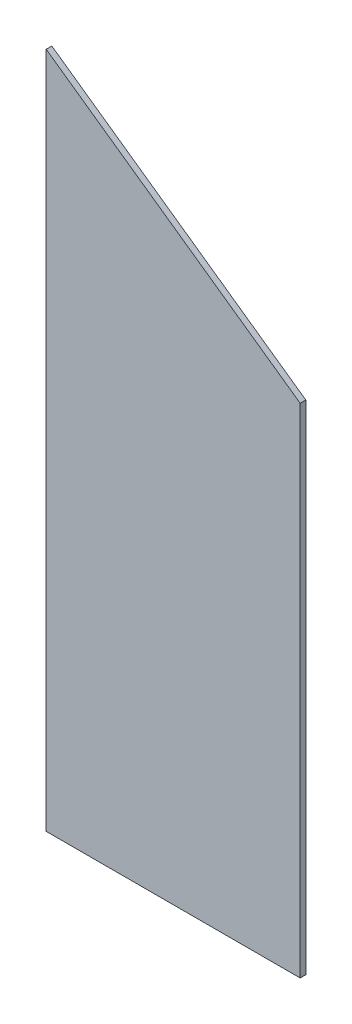
ISO-10303-21;
HEADER;
FILE_DESCRIPTION(('STEP AP214'),'2;1');
FILE_NAME('part.step','',(''),(''),'','','');
FILE_SCHEMA(('AUTOMOTIVE_DESIGN { 1 0 10303 214 1 1 1 1 }'));
ENDSEC;
DATA;
#1=APPLICATION_CONTEXT('core data for automotive mechanical design processes');
#2=APPLICATION_PROTOCOL_DEFINITION('international standard','automotive_design',2000,#1);
#3=PRODUCT_CONTEXT('',#1,'mechanical');
#4=PRODUCT('Part','Part','',(#3));
#5=PRODUCT_RELATED_PRODUCT_CATEGORY('part','',(#4));
#6=PRODUCT_DEFINITION_FORMATION('','',#4);
#7=PRODUCT_DEFINITION_CONTEXT('part definition',#1,'design');
#8=PRODUCT_DEFINITION('design','',#6,#7);
#9=PRODUCT_DEFINITION_SHAPE('','',#8);
#10=(LENGTH_UNIT() NAMED_UNIT(*) SI_UNIT(.MILLI.,.METRE.));
#11=(NAMED_UNIT(*) PLANE_ANGLE_UNIT() SI_UNIT($,.RADIAN.));
#12=(NAMED_UNIT(*) SI_UNIT($,.STERADIAN.) SOLID_ANGLE_UNIT());
#13=UNCERTAINTY_MEASURE_WITH_UNIT(LENGTH_MEASURE(1.E-05),#10,'distance_accuracy_value','');
#14=(GEOMETRIC_REPRESENTATION_CONTEXT(3) GLOBAL_UNCERTAINTY_ASSIGNED_CONTEXT((#13)) GLOBAL_UNIT_ASSIGNED_CONTEXT((#10,
#11,#12)) REPRESENTATION_CONTEXT('',''));
#15=CARTESIAN_POINT('',(0.,0.,0.));
#16=DIRECTION('',(0.,0.,1.));
#17=DIRECTION('',(1.,0.,0.));
#18=AXIS2_PLACEMENT_3D('',#15,#16,#17);
#19=CARTESIAN_POINT('',(90.,352.783521086218,-93.4));
#20=DIRECTION('',(-1.,0.,0.));
#21=DIRECTION('',(0.,-1.,0.));
#22=AXIS2_PLACEMENT_3D('',#19,#20,#21);
#23=PLANE('',#22);
#24=DIRECTION('',(0.,-1.,0.));
#25=VECTOR('',#24,1.);
#26=CARTESIAN_POINT('',(90.,352.783521086218,-89.4));
#27=LINE('',#26,#25);
#28=CARTESIAN_POINT('',(90.,352.783521086218,-89.4));
#29=VERTEX_POINT('',#28);
#30=CARTESIAN_POINT('',(90.,0.,-89.4));
#31=VERTEX_POINT('',#30);
#32=EDGE_CURVE('E109',#29,#31,#27,.T.);
#33=ORIENTED_EDGE('',*,*,#32,.T.);
#34=DIRECTION('',(0.,0.,1.));
#35=VECTOR('',#34,1.);
#36=CARTESIAN_POINT('',(90.,0.,-93.4));
#37=LINE('',#36,#35);
#38=CARTESIAN_POINT('',(90.,0.,-93.4));
#39=VERTEX_POINT('',#38);
#40=EDGE_CURVE('E11',#39,#31,#37,.T.);
#41=ORIENTED_EDGE('',*,*,#40,.F.);
#42=DIRECTION('',(0.,-1.,0.));
#43=VECTOR('',#42,1.);
#44=CARTESIAN_POINT('',(90.,352.783521086218,-93.4));
#45=LINE('',#44,#43);
#46=CARTESIAN_POINT('',(90.,352.783521086218,-93.4));
#47=VERTEX_POINT('',#46);
#48=EDGE_CURVE('E92',#47,#39,#45,.T.);
#49=ORIENTED_EDGE('',*,*,#48,.F.);
#50=DIRECTION('',(0.,0.,1.));
#51=VECTOR('',#50,1.);
#52=CARTESIAN_POINT('',(90.,352.783521086218,-93.4));
#53=LINE('',#52,#51);
#54=EDGE_CURVE('E105',#47,#29,#53,.T.);
#55=ORIENTED_EDGE('',*,*,#54,.T.);
#56=EDGE_LOOP('',(#33,#41,#49,#55));
#57=FACE_BOUND('',#56,.T.);
#58=ADVANCED_FACE('F40',(#57),#23,.F.);
#59=CARTESIAN_POINT('',(90.,0.,-93.4));
#60=DIRECTION('',(0.,1.,0.));
#61=DIRECTION('',(0.,0.,1.));
#62=AXIS2_PLACEMENT_3D('',#59,#60,#61);
#63=PLANE('',#62);
#64=DIRECTION('',(-1.,0.,0.));
#65=VECTOR('',#64,1.);
#66=CARTESIAN_POINT('',(90.,0.,-89.4));
#67=LINE('',#66,#65);
#68=CARTESIAN_POINT('',(-90.,0.,-89.4));
#69=VERTEX_POINT('',#68);
#70=EDGE_CURVE('E97',#31,#69,#67,.T.);
#71=ORIENTED_EDGE('',*,*,#70,.T.);
#72=DIRECTION('',(0.,0.,1.));
#73=VECTOR('',#72,1.);
#74=CARTESIAN_POINT('',(-90.,0.,-93.4));
#75=LINE('',#74,#73);
#76=CARTESIAN_POINT('',(-90.,0.,-93.4));
#77=VERTEX_POINT('',#76);
#78=EDGE_CURVE('E49',#77,#69,#75,.T.);
#79=ORIENTED_EDGE('',*,*,#78,.F.);
#80=DIRECTION('',(-1.,0.,0.));
#81=VECTOR('',#80,1.);
#82=CARTESIAN_POINT('',(90.,0.,-93.4));
#83=LINE('',#82,#81);
#84=EDGE_CURVE('E87',#39,#77,#83,.T.);
#85=ORIENTED_EDGE('',*,*,#84,.F.);
#86=ORIENTED_EDGE('',*,*,#40,.T.);
#87=EDGE_LOOP('',(#71,#79,#85,#86));
#88=FACE_BOUND('',#87,.T.);
#89=ADVANCED_FACE('F96',(#88),#63,.F.);
#90=CARTESIAN_POINT('',(-90.,0.,-93.4));
#91=DIRECTION('',(1.,0.,0.));
#92=DIRECTION('',(0.,0.,-1.));
#93=AXIS2_PLACEMENT_3D('',#90,#91,#92);
#94=PLANE('',#93);
#95=DIRECTION('',(0.,1.,0.));
#96=VECTOR('',#95,1.);
#97=CARTESIAN_POINT('',(-90.,0.,-89.4));
#98=LINE('',#97,#96);
#99=CARTESIAN_POINT('',(-90.,480.062741699798,-89.4));
#100=VERTEX_POINT('',#99);
#101=EDGE_CURVE('E74',#69,#100,#98,.T.);
#102=ORIENTED_EDGE('',*,*,#101,.T.);
#103=DIRECTION('',(0.,0.,1.));
#104=VECTOR('',#103,1.);
#105=CARTESIAN_POINT('',(-90.,480.062741699798,-93.4));
#106=LINE('',#105,#104);
#107=CARTESIAN_POINT('',(-90.,480.062741699798,-93.4));
#108=VERTEX_POINT('',#107);
#109=EDGE_CURVE('E99',#108,#100,#106,.T.);
#110=ORIENTED_EDGE('',*,*,#109,.F.);
#111=DIRECTION('',(0.,1.,0.));
#112=VECTOR('',#111,1.);
#113=CARTESIAN_POINT('',(-90.,0.,-93.4));
#114=LINE('',#113,#112);
#115=EDGE_CURVE('E90',#77,#108,#114,.T.);
#116=ORIENTED_EDGE('',*,*,#115,.F.);
#117=ORIENTED_EDGE('',*,*,#78,.T.);
#118=EDGE_LOOP('',(#102,#110,#116,#117));
#119=FACE_BOUND('',#118,.T.);
#120=ADVANCED_FACE('F100',(#119),#94,.F.);
#121=CARTESIAN_POINT('',(-90.,480.062741699798,-93.4));
#122=DIRECTION('',(-0.577350269189629,-0.816496580927723,0.));
#123=DIRECTION('',(0.816496580927723,-0.577350269189629,0.));
#124=AXIS2_PLACEMENT_3D('',#121,#122,#123);
#125=PLANE('',#124);
#126=DIRECTION('',(0.816496580927723,-0.577350269189629,0.));
#127=VECTOR('',#126,1.);
#128=CARTESIAN_POINT('',(-90.,480.062741699798,-89.4));
#129=LINE('',#128,#127);
#130=EDGE_CURVE('E80',#100,#29,#129,.T.);
#131=ORIENTED_EDGE('',*,*,#130,.T.);
#132=ORIENTED_EDGE('',*,*,#54,.F.);
#133=DIRECTION('',(0.816496580927723,-0.577350269189629,0.));
#134=VECTOR('',#133,1.);
#135=CARTESIAN_POINT('',(-90.,480.062741699798,-93.4));
#136=LINE('',#135,#134);
#137=EDGE_CURVE('E57',#108,#47,#136,.T.);
#138=ORIENTED_EDGE('',*,*,#137,.F.);
#139=ORIENTED_EDGE('',*,*,#109,.T.);
#140=EDGE_LOOP('',(#131,#132,#138,#139));
#141=FACE_BOUND('',#140,.T.);
#142=ADVANCED_FACE('F124',(#141),#125,.F.);
#143=CARTESIAN_POINT('',(0.,0.,-93.4));
#144=DIRECTION('',(0.,0.,-1.));
#145=DIRECTION('',(-1.,0.,0.));
#146=AXIS2_PLACEMENT_3D('',#143,#144,#145);
#147=PLANE('',#146);
#148=ORIENTED_EDGE('',*,*,#48,.T.);
#149=ORIENTED_EDGE('',*,*,#84,.T.);
#150=ORIENTED_EDGE('',*,*,#115,.T.);
#151=ORIENTED_EDGE('',*,*,#137,.T.);
#152=EDGE_LOOP('',(#148,#149,#150,#151));
#153=FACE_BOUND('',#152,.T.);
#154=ADVANCED_FACE('F88',(#153),#147,.T.);
#155=CARTESIAN_POINT('',(0.,0.,-89.4));
#156=DIRECTION('',(0.,0.,-1.));
#157=DIRECTION('',(-1.,0.,0.));
#158=AXIS2_PLACEMENT_3D('',#155,#156,#157);
#159=PLANE('',#158);
#160=ORIENTED_EDGE('',*,*,#32,.F.);
#161=ORIENTED_EDGE('',*,*,#130,.F.);
#162=ORIENTED_EDGE('',*,*,#101,.F.);
#163=ORIENTED_EDGE('',*,*,#70,.F.);
#164=EDGE_LOOP('',(#160,#161,#162,#163));
#165=FACE_BOUND('',#164,.T.);
#166=ADVANCED_FACE('F127',(#165),#159,.F.);
#167=CLOSED_SHELL('',(#58,#89,#120,#142,#154,#166));
#168=MANIFOLD_SOLID_BREP('B2',#167);
#169=ADVANCED_BREP_SHAPE_REPRESENTATION('',(#18,#168),#14);
#170=SHAPE_DEFINITION_REPRESENTATION(#9,#169);
ENDSEC;
END-ISO-10303-21;
